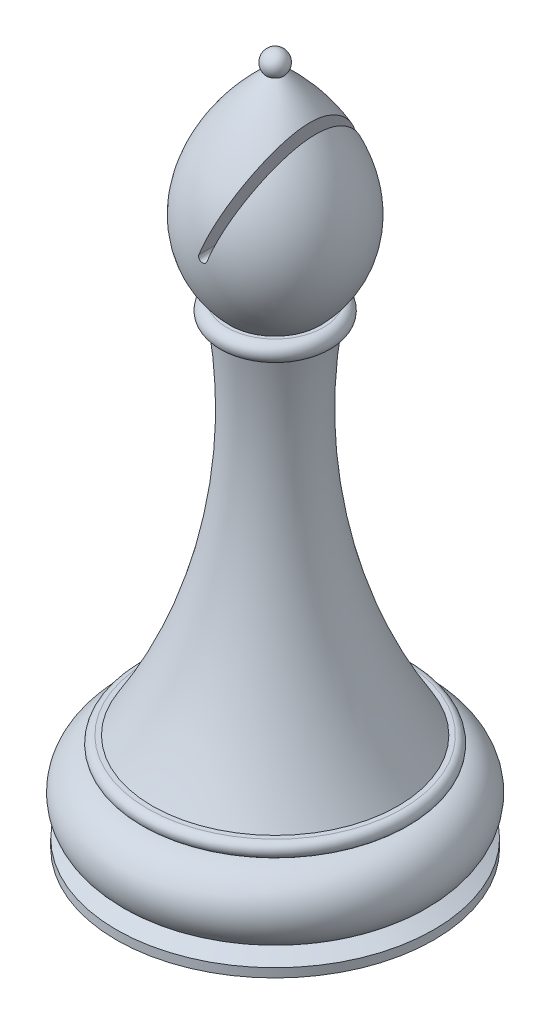
ISO-10303-21;
HEADER;
FILE_DESCRIPTION(('STEP AP214'),'2;1');
FILE_NAME('part.step','',(''),(''),'','','');
FILE_SCHEMA(('AUTOMOTIVE_DESIGN { 1 0 10303 214 1 1 1 1 }'));
ENDSEC;
DATA;
#1=APPLICATION_CONTEXT('core data for automotive mechanical design processes');
#2=APPLICATION_PROTOCOL_DEFINITION('international standard','automotive_design',2000,#1);
#3=PRODUCT_CONTEXT('',#1,'mechanical');
#4=PRODUCT('Part','Part','',(#3));
#5=PRODUCT_RELATED_PRODUCT_CATEGORY('part','',(#4));
#6=PRODUCT_DEFINITION_FORMATION('','',#4);
#7=PRODUCT_DEFINITION_CONTEXT('part definition',#1,'design');
#8=PRODUCT_DEFINITION('design','',#6,#7);
#9=PRODUCT_DEFINITION_SHAPE('','',#8);
#10=(LENGTH_UNIT() NAMED_UNIT(*) SI_UNIT(.MILLI.,.METRE.));
#11=(NAMED_UNIT(*) PLANE_ANGLE_UNIT() SI_UNIT($,.RADIAN.));
#12=(NAMED_UNIT(*) SI_UNIT($,.STERADIAN.) SOLID_ANGLE_UNIT());
#13=UNCERTAINTY_MEASURE_WITH_UNIT(LENGTH_MEASURE(1.E-05),#10,'distance_accuracy_value','');
#14=(GEOMETRIC_REPRESENTATION_CONTEXT(3) GLOBAL_UNCERTAINTY_ASSIGNED_CONTEXT((#13)) GLOBAL_UNIT_ASSIGNED_CONTEXT((#10,
#11,#12)) REPRESENTATION_CONTEXT('',''));
#15=CARTESIAN_POINT('',(0.,0.,0.));
#16=DIRECTION('',(0.,0.,1.));
#17=DIRECTION('',(1.,0.,0.));
#18=AXIS2_PLACEMENT_3D('',#15,#16,#17);
#19=CARTESIAN_POINT('',(0.,36.9784470449583,0.));
#20=DIRECTION('',(0.,1.,0.));
#21=DIRECTION('',(0.,0.,1.));
#22=AXIS2_PLACEMENT_3D('',#19,#20,#21);
#23=PLANE('',#22);
#24=CARTESIAN_POINT('',(0.,36.9784470449583,0.));
#25=DIRECTION('',(0.,1.,0.));
#26=DIRECTION('',(0.,0.,1.));
#27=AXIS2_PLACEMENT_3D('',#24,#25,#26);
#28=CIRCLE('',#27,4.72944569700411);
#29=CARTESIAN_POINT('',(0.,36.9784470449583,4.72944569700411));
#30=VERTEX_POINT('',#29);
#31=EDGE_CURVE('E80',#30,#30,#28,.T.);
#32=ORIENTED_EDGE('',*,*,#31,.T.);
#33=EDGE_LOOP('',(#32));
#34=FACE_BOUND('',#33,.T.);
#35=CARTESIAN_POINT('',(0.,36.9784470449583,0.));
#36=DIRECTION('',(0.,1.,0.));
#37=DIRECTION('',(0.,0.,1.));
#38=AXIS2_PLACEMENT_3D('',#35,#36,#37);
#39=CIRCLE('',#38,4.3896081644279);
#40=CARTESIAN_POINT('',(0.,36.9784470449583,4.3896081644279));
#41=VERTEX_POINT('',#40);
#42=EDGE_CURVE('E72',#41,#41,#39,.T.);
#43=ORIENTED_EDGE('',*,*,#42,.F.);
#44=EDGE_LOOP('',(#43));
#45=FACE_BOUND('',#44,.T.);
#46=ADVANCED_FACE('F37',(#34,#45),#23,.T.);
#47=CARTESIAN_POINT('',(0.,57.1409039617706,0.));
#48=CARTESIAN_POINT('',(8.61172594802059,49.7983263734243,0.));
#49=CARTESIAN_POINT('',(9.38242243643497,41.9727549857802,0.));
#50=CARTESIAN_POINT('',(4.38960816442791,36.9784470449583,0.));
#51=B_SPLINE_CURVE_WITH_KNOTS('',3,(#47,#48,#49,#50),.UNSPECIFIED.,.F.,.F.,(4,4),(0.,
0.785114143224246),.UNSPECIFIED.);
#52=CARTESIAN_POINT('',(0.,0.,0.));
#53=DIRECTION('',(0.,1.,0.));
#54=AXIS1_PLACEMENT('',#52,#53);
#55=SURFACE_OF_REVOLUTION('',#51,#54);
#56=CARTESIAN_POINT('',(0.733907030203132,44.2730125457096,7.4454363789582));
#57=CARTESIAN_POINT('',(0.826755817906949,44.5226929652169,7.43440604822771));
#58=CARTESIAN_POINT('',(0.919424793475852,44.7718898504704,7.41251392828907));
#59=CARTESIAN_POINT('',(1.10382431653597,45.2677600865091,7.34796028636145));
#60=CARTESIAN_POINT('',(1.19555541447912,45.5144349175189,7.30531175716813));
#61=CARTESIAN_POINT('',(1.37738341438092,46.0033900500132,7.20031866418594));
#62=CARTESIAN_POINT('',(1.46748391554859,46.2456800301594,7.13802508999688));
#63=CARTESIAN_POINT('',(1.64587025702048,46.7253801713735,6.99472045713961));
#64=CARTESIAN_POINT('',(1.73415573404838,46.962789355552,6.91370569039474));
#65=CARTESIAN_POINT('',(1.91789320240284,47.4568792549731,6.72428224015033));
#66=CARTESIAN_POINT('',(2.0130936810983,47.7128836255826,6.61386353570363));
#67=CARTESIAN_POINT('',(2.20028829960596,48.2162701752013,6.37253136502893));
#68=CARTESIAN_POINT('',(2.29228212959447,48.463651521061,6.24161592509743));
#69=CARTESIAN_POINT('',(2.47274658625777,48.9489399384993,5.96007648026663));
#70=CARTESIAN_POINT('',(2.56121045031514,49.1868288246691,5.80941681186059));
#71=CARTESIAN_POINT('',(2.73390565729259,49.6512248904807,5.48935162962437));
#72=CARTESIAN_POINT('',(2.81813772435128,49.8777340174094,5.31994933899906));
#73=CARTESIAN_POINT('',(2.9680988748079,50.2809957495415,4.99256679133824));
#74=CARTESIAN_POINT('',(3.0345722265922,50.4597497728304,4.83738745820486));
#75=CARTESIAN_POINT('',(3.16366692713893,50.8068993671956,4.51426597415873));
#76=CARTESIAN_POINT('',(3.22628785852601,50.9752938159044,4.34632244474999));
#77=CARTESIAN_POINT('',(3.34690185993734,51.2996378942234,3.99783446902832));
#78=CARTESIAN_POINT('',(3.40490308052126,51.455609441569,3.8173133184066));
#79=CARTESIAN_POINT('',(3.51548520017759,51.7529767062216,3.44310400010293));
#80=CARTESIAN_POINT('',(3.56806887442076,51.8943798862626,3.24942265904315));
#81=CARTESIAN_POINT('',(3.64817642366819,52.1097977392733,2.92334995869069));
#82=CARTESIAN_POINT('',(3.67773067278747,52.1892723075559,2.79505009894472));
#83=CARTESIAN_POINT('',(3.73381803575491,52.3400972850391,2.53305008886002));
#84=CARTESIAN_POINT('',(3.7603505186107,52.411445997433,2.39934881848917));
#85=CARTESIAN_POINT('',(3.80987385571422,52.5446196003329,2.1268469697959));
#86=CARTESIAN_POINT('',(3.83286930072745,52.6064568359032,1.98805329593343));
#87=CARTESIAN_POINT('',(3.87480370716973,52.7192229845114,1.70556475218944));
#88=CARTESIAN_POINT('',(3.89374524781664,52.7701588333447,1.56187306644892));
#89=CARTESIAN_POINT('',(3.92410758378489,52.8518064344524,1.29561888537211));
#90=CARTESIAN_POINT('',(3.93626405093708,52.884496487746,1.17374723592141));
#91=CARTESIAN_POINT('',(3.95712670189097,52.9405984097099,0.927589525064135));
#92=CARTESIAN_POINT('',(3.96583328536356,52.9640113531384,0.803303745086953));
#93=CARTESIAN_POINT('',(3.9795370596699,53.000862282507,0.553175225083757));
#94=CARTESIAN_POINT('',(3.98453794790712,53.0143102111645,0.427334164698348));
#95=CARTESIAN_POINT('',(3.99068472844329,53.0308395679913,0.174871827150178));
#96=CARTESIAN_POINT('',(3.99183059827515,53.0339209357442,0.0482505454445859));
#97=CARTESIAN_POINT('',(3.9902279904956,53.0296113503139,-0.20491409534417));
#98=CARTESIAN_POINT('',(3.98747561682377,53.0222099202035,-0.331457249835229));
#99=CARTESIAN_POINT('',(3.97816092925459,52.9971617191729,-0.583373327331995));
#100=CARTESIAN_POINT('',(3.97159862537914,52.9795149752027,-0.708746253415069));
#101=CARTESIAN_POINT('',(3.95485978142686,52.9345024157129,-0.957590723745254));
#102=CARTESIAN_POINT('',(3.94468006749866,52.9071280653642,-1.0810604986268));
#103=CARTESIAN_POINT('',(3.92098304565253,52.8434042139071,-1.32538612420962));
#104=CARTESIAN_POINT('',(3.9074637918935,52.8070494802217,-1.44624040613798));
#105=CARTESIAN_POINT('',(3.87177393041136,52.7110755875367,-1.72951493355215));
#106=CARTESIAN_POINT('',(3.84825964742706,52.6478431406182,-1.89054588190079));
#107=CARTESIAN_POINT('',(3.79635230237821,52.5082586828367,-2.2060172063677));
#108=CARTESIAN_POINT('',(3.76795662108209,52.4318996285771,-2.36045398840037));
#109=CARTESIAN_POINT('',(3.70697332014779,52.26790894505,-2.66277521577281));
#110=CARTESIAN_POINT('',(3.67437652660897,52.1802526461726,-2.81064434001443));
#111=CARTESIAN_POINT('',(3.60567037821029,51.9954943916046,-3.09945249720473));
#112=CARTESIAN_POINT('',(3.56956099023351,51.898392346859,-3.24039146479666));
#113=CARTESIAN_POINT('',(3.47293563593887,51.6385563318505,-3.59373346246044));
#114=CARTESIAN_POINT('',(3.41021799744106,51.4699018272748,-3.80119640412418));
#115=CARTESIAN_POINT('',(3.27881752920076,51.1165517745165,-4.19997692327133));
#116=CARTESIAN_POINT('',(3.21013140502158,50.9318473672377,-4.39128546763496));
#117=CARTESIAN_POINT('',(3.06771427944934,50.5488723329128,-4.75821643910134));
#118=CARTESIAN_POINT('',(2.99397754080658,50.3505862777824,-4.93382048677649));
#119=CARTESIAN_POINT('',(2.84225643117181,49.9425918253124,-5.26906507967802));
#120=CARTESIAN_POINT('',(2.76427285850365,49.7328855747518,-5.4287086092863));
#121=CARTESIAN_POINT('',(2.60095657292474,49.2937104416764,-5.73864374325561));
#122=CARTESIAN_POINT('',(2.51545101358735,49.0637767564498,-5.88818735980509));
#123=CARTESIAN_POINT('',(2.34087106105433,48.5943124062522,-6.1688999929199));
#124=CARTESIAN_POINT('',(2.25179629623957,48.3547807419572,-6.30006708972936));
#125=CARTESIAN_POINT('',(1.98027133287802,47.6246207858028,-6.66408001344689));
#126=CARTESIAN_POINT('',(1.79300223409964,47.121033950691,-6.8684209991736));
#127=CARTESIAN_POINT('',(1.46047656701746,46.2268365130371,-7.14814353645107));
#128=CARTESIAN_POINT('',(1.31721316005643,45.8415857366438,-7.24334060345302));
#129=CARTESIAN_POINT('',(1.09998006633427,45.2574224824671,-7.34826254458487));
#130=CARTESIAN_POINT('',(1.02709631447801,45.0614302009439,-7.37693507126104));
#131=CARTESIAN_POINT('',(0.880816545323486,44.6680681007899,-7.42115105986908));
#132=CARTESIAN_POINT('',(0.807420323435616,44.4706977319955,-7.43668893555976));
#133=CARTESIAN_POINT('',(0.733907030203128,44.2730125457096,-7.4454363789582));
#134=B_SPLINE_CURVE_WITH_KNOTS('',3,(#56,#57,#58,#59,#60,#61,#62,#63,#64,#65,#66,#67,#68,#69,
#70,#71,#72,#73,#74,#75,#76,#77,#78,#79,#80,#81,#82,#83,#84,#85,#86,#87,#88,#89,#90,#91,#92,#93,
#94,#95,#96,#97,#98,#99,#100,#101,#102,#103,#104,#105,#106,#107,#108,#109,#110,#111,#112,#113,
#114,#115,#116,#117,#118,#119,#120,#121,#122,#123,#124,#125,#126,#127,#128,#129,#130,#131,#132,
#133),.UNSPECIFIED.,.F.,.F.,(4,2,2,2,2,2,2,2,2,2,2,2,2,2,2,2,2,2,2,2,2,2,2,2,2,2,2,2,2,2,2,2,2,
2,2,2,2,2,4),(0.,0.799524790601596,1.59854974873583,2.39551763789129,3.19264351670808,
4.07557256798236,4.95858669198285,5.84321835078512,6.72769811354874,7.46478467147629,
8.20195094602673,8.93778641933541,9.67324306248616,10.1343215988829,10.5954962398884,
11.0560671718701,11.5163441976704,11.8962641680087,12.2761401115358,12.6556365168718,
13.0351351339139,13.4150133048044,13.7948904764422,14.1751017718479,14.5555351287213,
15.0784866707291,15.601719695836,16.1261152946876,16.6505158380475,17.4731386231721,
18.2962183928862,19.1202491643037,19.9441255647818,20.8052107801153,21.6663858842177,
23.3834373991223,24.6462059454122,25.2790112130547,25.9120854811335),.UNSPECIFIED.);
#135=CARTESIAN_POINT('',(0.733907030203132,44.2730125457096,7.4454363789582));
#136=VERTEX_POINT('',#135);
#137=CARTESIAN_POINT('',(0.733907030203132,44.2730125457096,-7.4454363789582));
#138=VERTEX_POINT('',#137);
#139=EDGE_CURVE('E11',#136,#138,#134,.T.);
#140=ORIENTED_EDGE('',*,*,#139,.F.);
#141=CARTESIAN_POINT('',(-1.23056946577105E-13,44.5459309354501,7.47586857043774));
#142=CARTESIAN_POINT('',(-0.00769073735361524,44.5253034543444,7.47656489600925));
#143=CARTESIAN_POINT('',(-0.0136057040780173,44.5040195985836,7.4772109298047));
#144=CARTESIAN_POINT('',(-0.0217932390263076,44.460774154118,7.47838952054637));
#145=CARTESIAN_POINT('',(-0.0240683642479139,44.4388130522448,7.47892215692632));
#146=CARTESIAN_POINT('',(-0.0248966142190294,44.3948067909726,7.47986229987358));
#147=CARTESIAN_POINT('',(-0.0234479441545796,44.3727615961552,7.48026974599509));
#148=CARTESIAN_POINT('',(-0.0168712129510625,44.3292298116641,7.48094512950491));
#149=CARTESIAN_POINT('',(-0.0117439114617629,44.3077431076092,7.48121309567659));
#150=CARTESIAN_POINT('',(0.00203816916475349,44.2659575929116,7.48159516646869));
#151=CARTESIAN_POINT('',(0.0106889990606607,44.2456574813465,7.48170944273294));
#152=CARTESIAN_POINT('',(0.0312870336152681,44.2067679621114,7.48177128694784));
#153=CARTESIAN_POINT('',(0.0432388259954951,44.1881809836798,7.48171862180594));
#154=CARTESIAN_POINT('',(0.07006704240656,44.1533128392362,7.48143522109956));
#155=CARTESIAN_POINT('',(0.0849377585110917,44.137027278053,7.48120483053939));
#156=CARTESIAN_POINT('',(0.117218811580259,44.1071593627676,7.48055893790509));
#157=CARTESIAN_POINT('',(0.134632676942235,44.0935808273582,7.48014317697319));
#158=CARTESIAN_POINT('',(0.17145912157518,44.0695592494855,7.47912602362401));
#159=CARTESIAN_POINT('',(0.19086853668818,44.0591113429943,7.47852492214834));
#160=CARTESIAN_POINT('',(0.231191481781675,44.0416013820417,7.47714162851064));
#161=CARTESIAN_POINT('',(0.252107468753663,44.0345450093101,7.47635913569682));
#162=CARTESIAN_POINT('',(0.294837140027839,44.0240373538785,7.47462706269031));
#163=CARTESIAN_POINT('',(0.316651524957899,44.0205889424292,7.47367735012358));
#164=CARTESIAN_POINT('',(0.36050633521873,44.0174041501665,7.47163578876218));
#165=CARTESIAN_POINT('',(0.382546328123475,44.0176616530254,7.47054417711185));
#166=CARTESIAN_POINT('',(0.426333638424837,44.0218698448115,7.46824509850904));
#167=CARTESIAN_POINT('',(0.448079845115479,44.0258319079049,7.46703728503052));
#168=CARTESIAN_POINT('',(0.490564075387551,44.0373425721168,7.46454926138331));
#169=CARTESIAN_POINT('',(0.511303456927992,44.0448861856054,7.46326915406777));
#170=CARTESIAN_POINT('',(0.551281589391728,44.0633711886886,7.46067574469811));
#171=CARTESIAN_POINT('',(0.570515694187021,44.0743226161758,7.45936235524781));
#172=CARTESIAN_POINT('',(0.606843135785194,44.0992880214779,7.45675677615789));
#173=CARTESIAN_POINT('',(0.623939438441421,44.1132976806569,7.45546455935841));
#174=CARTESIAN_POINT('',(0.655570345890263,44.1440217142273,7.45294688359369));
#175=CARTESIAN_POINT('',(0.670099771104132,44.1607414297214,7.45172156297931));
#176=CARTESIAN_POINT('',(0.696118949630374,44.1963731797001,7.44939097013848));
#177=CARTESIAN_POINT('',(0.707613369248528,44.2152817836236,7.44828551517988));
#178=CARTESIAN_POINT('',(0.723597365494547,44.2473795321468,7.44661923481531));
#179=CARTESIAN_POINT('',(0.729100219100249,44.2600695798212,7.44600912088709));
#180=CARTESIAN_POINT('',(0.733907030203133,44.2730125457096,7.4454363789582));
#181=B_SPLINE_CURVE_WITH_KNOTS('',3,(#141,#142,#143,#144,#145,#146,#147,#148,#149,#150,#151,
#152,#153,#154,#155,#156,#157,#158,#159,#160,#161,#162,#163,#164,#165,#166,#167,#168,#169,#170,
#171,#172,#173,#174,#175,#176,#177,#178,#179,#180),.UNSPECIFIED.,.F.,.F.,(4,2,2,2,2,2,2,2,2,2,2,
2,2,2,2,2,2,2,2,4),(0.,0.065989369584702,0.131932361084728,0.197907142085152,0.263868302991194,
0.329755735860008,0.395735204794564,0.461586914314584,0.527530870922397,0.593371833356816,
0.65932271591624,0.725326043001559,0.791220449161169,0.85731783857796,0.923323450236976,
0.98952535524623,1.05563437211642,1.12187530030031,1.18801378240604,1.22946905151401),.UNSPECIFIED.);
#182=CARTESIAN_POINT('',(0.,44.5459309354501,7.47586857043774));
#183=VERTEX_POINT('',#182);
#184=EDGE_CURVE('E68',#183,#136,#181,.T.);
#185=ORIENTED_EDGE('',*,*,#184,.F.);
#186=CARTESIAN_POINT('',(-1.87783816274489E-13,44.5459309354501,-7.47586857043775));
#187=CARTESIAN_POINT('',(0.0916861901524089,44.7924850045607,-7.46756901687327));
#188=CARTESIAN_POINT('',(0.18323383510521,45.0386665106639,-7.44886101409855));
#189=CARTESIAN_POINT('',(0.365513307287141,45.5288357008882,-7.39161022075856));
#190=CARTESIAN_POINT('',(0.456245645443252,45.7728247589471,-7.35308088349314));
#191=CARTESIAN_POINT('',(0.636140914543246,46.2565825695465,-7.25733685718182));
#192=CARTESIAN_POINT('',(0.725308479513355,46.496363783484,-7.20019330820493));
#193=CARTESIAN_POINT('',(0.902051439505605,46.9716446943853,-7.06820789739719));
#194=CARTESIAN_POINT('',(0.989626473365378,47.2071434201446,-6.99336207355425));
#195=CARTESIAN_POINT('',(1.17603901970641,47.7084268932306,-6.8143012143855));
#196=CARTESIAN_POINT('',(1.27455751248455,47.9733537621157,-6.70734805797486));
#197=CARTESIAN_POINT('',(1.46855266271462,48.4950276761196,-6.47272933132334));
#198=CARTESIAN_POINT('',(1.56402899646318,48.7517738507652,-6.34506156567491));
#199=CARTESIAN_POINT('',(1.75175353020654,49.2565853996947,-6.06989178118696));
#200=CARTESIAN_POINT('',(1.84399268496605,49.504626450364,-5.92233902200789));
#201=CARTESIAN_POINT('',(2.02452591450631,49.9900998054987,-5.60861152516583));
#202=CARTESIAN_POINT('',(2.11282054208663,50.2275335965018,-5.44243940840673));
#203=CARTESIAN_POINT('',(2.27470360126586,50.6628546289751,-5.11285139708365));
#204=CARTESIAN_POINT('',(2.34879249713625,50.8620876729305,-4.95145619550768));
#205=CARTESIAN_POINT('',(2.49303253478313,51.2499647147333,-4.61464835230591));
#206=CARTESIAN_POINT('',(2.56318291172384,51.4386066558546,-4.43923300397441));
#207=CARTESIAN_POINT('',(2.69869011789672,51.8030001705178,-4.07456103519668));
#208=CARTESIAN_POINT('',(2.7640572148899,51.9787793551781,-3.88533591496823));
#209=CARTESIAN_POINT('',(2.88914159202089,52.3151447566909,-3.49213382296411));
#210=CARTESIAN_POINT('',(2.94886257190482,52.4757409225603,-3.28816666805974));
#211=CARTESIAN_POINT('',(3.03583033636045,52.7096066352956,-2.95997752162308));
#212=CARTESIAN_POINT('',(3.0655894104237,52.7896319999776,-2.84121063388183));
#213=CARTESIAN_POINT('',(3.1225738713063,52.9428693706581,-2.59878718669358));
#214=CARTESIAN_POINT('',(3.14979995016546,53.0160832376264,-2.47513197601919));
#215=CARTESIAN_POINT('',(3.2012643701352,53.1544766220266,-2.22292684257835));
#216=CARTESIAN_POINT('',(3.22550533085047,53.2196631838584,-2.09438134288234));
#217=CARTESIAN_POINT('',(3.27049402860075,53.3406426517137,-1.8323340169799));
#218=CARTESIAN_POINT('',(3.29124245117786,53.3964374012338,-1.69883316974081));
#219=CARTESIAN_POINT('',(3.32515114255857,53.4876215351173,-1.45250229687207));
#220=CARTESIAN_POINT('',(3.33900493145027,53.5248758699105,-1.34045941450897));
#221=CARTESIAN_POINT('',(3.36365247151754,53.5911557675378,-1.11364643484223));
#222=CARTESIAN_POINT('',(3.3744470981285,53.6201836845124,-0.998877127965089));
#223=CARTESIAN_POINT('',(3.39264368627502,53.6691162756038,-0.767301750519156));
#224=CARTESIAN_POINT('',(3.40005053363671,53.6890340882348,-0.650498866918007));
#225=CARTESIAN_POINT('',(3.4112375127922,53.7191170835829,-0.415460716442452));
#226=CARTESIAN_POINT('',(3.41501772620943,53.7292824857942,-0.297225481866144));
#227=CARTESIAN_POINT('',(3.41881561713441,53.7394954247334,-0.0597333223388497));
#228=CARTESIAN_POINT('',(3.41881672567826,53.7394984057275,0.0595258092804918));
#229=CARTESIAN_POINT('',(3.41501494274515,53.7292750007581,0.297537517246781));
#230=CARTESIAN_POINT('',(3.41121206933964,53.7190486633906,0.416290095997501));
#231=CARTESIAN_POINT('',(3.39994170259687,53.6887414298129,0.652486775034257));
#232=CARTESIAN_POINT('',(3.39246984243453,53.6686487907384,0.769929145140359));
#233=CARTESIAN_POINT('',(3.37412133015419,53.6193076592406,1.002595881061));
#234=CARTESIAN_POINT('',(3.36324416233132,53.5900577800312,1.11781990811895));
#235=CARTESIAN_POINT('',(3.33469331635187,53.5132814711774,1.37957544305276));
#236=CARTESIAN_POINT('',(3.31595982957579,53.4629051016762,1.52515610126642));
#237=CARTESIAN_POINT('',(3.27404540418513,53.3501926842738,1.81101482278018));
#238=CARTESIAN_POINT('',(3.25086071521932,53.2878465512729,1.95128829436398));
#239=CARTESIAN_POINT('',(3.20070529148869,53.1529731991554,2.22649733296433));
#240=CARTESIAN_POINT('',(3.17372642045385,53.0804241007297,2.36142060821921));
#241=CARTESIAN_POINT('',(3.11662954613459,52.9268844381752,2.62558667071897));
#242=CARTESIAN_POINT('',(3.08651233247096,52.8458959974221,2.75483087526406));
#243=CARTESIAN_POINT('',(3.00183369513966,52.6181859947919,3.09550770941875));
#244=CARTESIAN_POINT('',(2.94478812682139,52.4647842996161,3.30187274630613));
#245=CARTESIAN_POINT('',(2.82477801115876,52.1420641353051,3.69993569879938));
#246=CARTESIAN_POINT('',(2.7618095272615,51.9727350803539,3.89162370389008));
#247=CARTESIAN_POINT('',(2.63093502924619,51.6207994183439,4.26137055084473));
#248=CARTESIAN_POINT('',(2.5630187317149,51.4381651580761,4.4393993315154));
#249=CARTESIAN_POINT('',(2.42313884663956,51.0620130375147,4.78169908158659));
#250=CARTESIAN_POINT('',(2.35117585630101,50.8684967831711,4.94597207218779));
#251=CARTESIAN_POINT('',(2.17972102702735,50.4074362269871,5.31207648617393));
#252=CARTESIAN_POINT('',(2.07888377377989,50.1362739607314,5.50876173271726));
#253=CARTESIAN_POINT('',(1.87190226015111,49.5796783127828,5.87744618595681));
#254=CARTESIAN_POINT('',(1.76575617891484,49.2942400346143,6.04943684336615));
#255=CARTESIAN_POINT('',(1.4408717080529,48.4205905989833,6.52544690887147));
#256=CARTESIAN_POINT('',(1.21492291848265,47.8129898972143,6.79113217542682));
#257=CARTESIAN_POINT('',(0.903301229990784,46.9750055160003,7.06661184950237));
#258=CARTESIAN_POINT('',(0.823003684135576,46.7590767415875,7.12984017415348));
#259=CARTESIAN_POINT('',(0.661153607404032,46.3238444024788,7.24137176319738));
#260=CARTESIAN_POINT('',(0.579601445907534,46.1045418310851,7.28967933545301));
#261=CARTESIAN_POINT('',(0.415381531357512,45.6629367420965,7.37066897499027));
#262=CARTESIAN_POINT('',(0.332711777350886,45.4406288437226,7.40331764916124));
#263=CARTESIAN_POINT('',(0.166732963191005,44.9942938836897,7.45214364122228));
#264=CARTESIAN_POINT('',(0.0834235314924852,44.7702658229053,7.46831051999129));
#265=CARTESIAN_POINT('',(0.,44.54593093545,7.47586857043773));
#266=B_SPLINE_CURVE_WITH_KNOTS('',3,(#186,#187,#188,#189,#190,#191,#192,#193,#194,#195,#196,
#197,#198,#199,#200,#201,#202,#203,#204,#205,#206,#207,#208,#209,#210,#211,#212,#213,#214,#215,
#216,#217,#218,#219,#220,#221,#222,#223,#224,#225,#226,#227,#228,#229,#230,#231,#232,#233,#234,
#235,#236,#237,#238,#239,#240,#241,#242,#243,#244,#245,#246,#247,#248,#249,#250,#251,#252,#253,
#254,#255,#256,#257,#258,#259,#260,#261,#262,#263,#264,#265),.UNSPECIFIED.,.F.,.F.,(4,2,2,2,2,2,
2,2,2,2,2,2,2,2,2,2,2,2,2,2,2,2,2,2,2,2,2,2,2,2,2,2,2,2,2,2,2,2,2,4),(0.,0.78923706370086,
1.57793915525913,2.36366166041368,3.1495601877388,4.05530217661618,4.9611402220111,
5.86933506781099,6.77740223422141,7.57752003574699,8.37779268151401,9.17629375406496,
9.97426791050343,10.4128689209163,10.8513497470377,11.2894429977985,11.7274501557337,
12.0837871543535,12.4400220773979,12.7957416088762,13.1514531341055,13.5087242254405,
13.865993619508,14.2236892697716,14.5814391162228,15.0462573543967,15.5114689566778,
15.9776938205219,16.4438016620892,17.2327046424498,18.0221357077491,18.813257080437,
19.6042620053494,20.6523587615567,21.7008174993033,23.7896321480826,24.506014967664,
25.2221907621698,25.939887108053,26.6580377414056),.UNSPECIFIED.);
#267=CARTESIAN_POINT('',(0.,44.5459309354501,-7.47586857043775));
#268=VERTEX_POINT('',#267);
#269=EDGE_CURVE('E64',#268,#183,#266,.T.);
#270=ORIENTED_EDGE('',*,*,#269,.F.);
#271=CARTESIAN_POINT('',(0.733907030203132,44.2730125457096,-7.4454363789582));
#272=CARTESIAN_POINT('',(0.726237744188731,44.2523357359868,-7.44635060187624));
#273=CARTESIAN_POINT('',(0.716791785210404,44.2323306084104,-7.44735985540194));
#274=CARTESIAN_POINT('',(0.694698034351575,44.1942029511871,-7.4495227486253));
#275=CARTESIAN_POINT('',(0.682052771005736,44.1760789506909,-7.45067627393698));
#276=CARTESIAN_POINT('',(0.653892934103179,44.1422115455465,-7.45308411551272));
#277=CARTESIAN_POINT('',(0.638377175686931,44.1264691288444,-7.45433847327622));
#278=CARTESIAN_POINT('',(0.604928424291505,44.0978172463655,-7.45689765616114));
#279=CARTESIAN_POINT('',(0.58699584515956,44.0849072965602,-7.45820247261498));
#280=CARTESIAN_POINT('',(0.549207050937631,44.0622758010223,-7.46081383135771));
#281=CARTESIAN_POINT('',(0.529349791196551,44.0525559994887,-7.46212037419987));
#282=CARTESIAN_POINT('',(0.488252933483663,44.0365787873874,-7.46468870256815));
#283=CARTESIAN_POINT('',(0.467011435861035,44.0303262518914,-7.46595042275286));
#284=CARTESIAN_POINT('',(0.423802474126914,44.0214899853839,-7.46838252768912));
#285=CARTESIAN_POINT('',(0.401835991263172,44.0189014880446,-7.46955302922399));
#286=CARTESIAN_POINT('',(0.357742986786208,44.017453385722,-7.47176981866329));
#287=CARTESIAN_POINT('',(0.33561628439282,44.018598997932,-7.47281593065867));
#288=CARTESIAN_POINT('',(0.291926861811367,44.0245927804274,-7.4747508751185));
#289=CARTESIAN_POINT('',(0.270362729877039,44.029430523379,-7.47564014185376));
#290=CARTESIAN_POINT('',(0.228312384569747,44.042672999341,-7.47724677925833));
#291=CARTESIAN_POINT('',(0.207828020361986,44.0510836414543,-7.47796386206913));
#292=CARTESIAN_POINT('',(0.168595413427379,44.0712182847594,-7.47921212621701));
#293=CARTESIAN_POINT('',(0.149844323601628,44.0829367193572,-7.47974361654939));
#294=CARTESIAN_POINT('',(0.114604858441396,44.1093383434221,-7.48061859251431));
#295=CARTESIAN_POINT('',(0.0981127479182404,44.124016537119,-7.48096239137312));
#296=CARTESIAN_POINT('',(0.0678177045556355,44.155940317428,-7.48146711882779));
#297=CARTESIAN_POINT('',(0.0540158694073343,44.1731869469762,-7.48162797290707));
#298=CARTESIAN_POINT('',(0.0295202591977875,44.2097270996994,-7.48177527181391));
#299=CARTESIAN_POINT('',(0.0188221543837162,44.2290177196517,-7.48176196081201));
#300=CARTESIAN_POINT('',(0.000800950332346205,44.2691416426665,-7.48157359890314));
#301=CARTESIAN_POINT('',(-0.00651828184721818,44.2899766818077,-7.48139836336131));
#302=CARTESIAN_POINT('',(-0.0175481112476018,44.3325481973956,-7.48090017634127));
#303=CARTESIAN_POINT('',(-0.021263743367023,44.3542833717544,-7.48057743189135));
#304=CARTESIAN_POINT('',(-0.0250052050174822,44.3981062087086,-7.47979779281199));
#305=CARTESIAN_POINT('',(-0.0250241579588494,44.4201944517886,-7.47934064975458));
#306=CARTESIAN_POINT('',(-0.0213524170276196,44.4640290118981,-7.47830653152381));
#307=CARTESIAN_POINT('',(-0.0176674211616322,44.4857758020158,-7.47772974149222));
#308=CARTESIAN_POINT('',(-0.00881004704210485,44.5202164158739,-7.47670910000086));
#309=CARTESIAN_POINT('',(-0.00473949975969323,44.5332022478565,-7.47629834210864));
#310=CARTESIAN_POINT('',(0.,44.54593093545,-7.47586857043774));
#311=B_SPLINE_CURVE_WITH_KNOTS('',3,(#271,#272,#273,#274,#275,#276,#277,#278,#279,#280,#281,
#282,#283,#284,#285,#286,#287,#288,#289,#290,#291,#292,#293,#294,#295,#296,#297,#298,#299,#300,
#301,#302,#303,#304,#305,#306,#307,#308,#309,#310),.UNSPECIFIED.,.F.,.F.,(4,2,2,2,2,2,2,2,2,2,2,
2,2,2,2,2,2,2,2,4),(0.,0.0661274278932727,0.13220275508394,0.198305417408763,0.264396774911547,
0.330524207599454,0.396744383054964,0.46287833723903,0.529104731520583,0.595144777876646,
0.661294473590287,0.727333504752491,0.793261988067064,0.859217315591621,0.925080187036931,
0.991018251586691,1.05686405512109,1.12283234433528,1.18869930565583,1.22946757212788),.UNSPECIFIED.);
#312=EDGE_CURVE('E48',#138,#268,#311,.T.);
#313=ORIENTED_EDGE('',*,*,#312,.F.);
#314=EDGE_LOOP('',(#140,#185,#270,#313));
#315=FACE_BOUND('',#314,.T.);
#316=ORIENTED_EDGE('',*,*,#42,.T.);
#317=EDGE_LOOP('',(#316));
#318=FACE_BOUND('',#317,.T.);
#319=CARTESIAN_POINT('',(0.,56.3915813395235,0.));
#320=DIRECTION('',(0.,1.,0.));
#321=DIRECTION('',(0.,0.,1.));
#322=AXIS2_PLACEMENT_3D('',#319,#320,#321);
#323=CIRCLE('',#322,0.8500077829545);
#324=CARTESIAN_POINT('',(0.,56.3915813395235,0.8500077829545));
#325=VERTEX_POINT('',#324);
#326=EDGE_CURVE('E168',#325,#325,#323,.T.);
#327=ORIENTED_EDGE('',*,*,#326,.F.);
#328=EDGE_LOOP('',(#327));
#329=FACE_BOUND('',#328,.T.);
#330=ADVANCED_FACE('F66',(#315,#318,#329),#55,.F.);
#331=CARTESIAN_POINT('',(0.,57.1409039617706,0.));
#332=DIRECTION('',(0.,1.,0.));
#333=DIRECTION('',(1.,0.,0.));
#334=AXIS2_PLACEMENT_3D('',#331,#332,#333);
#335=SPHERICAL_SURFACE('',#334,1.13313618920873);
#336=ORIENTED_EDGE('',*,*,#326,.T.);
#337=EDGE_LOOP('',(#336));
#338=FACE_BOUND('',#337,.T.);
#339=ADVANCED_FACE('F94',(#338),#335,.T.);
#340=CARTESIAN_POINT('',(0.,-9.62189923178285,0.));
#341=DIRECTION('',(0.,1.,0.));
#342=DIRECTION('',(0.,0.,1.));
#343=AXIS2_PLACEMENT_3D('',#340,#341,#342);
#344=PLANE('',#343);
#345=CARTESIAN_POINT('',(0.,-9.62189923178285,0.));
#346=DIRECTION('',(0.,1.,0.));
#347=DIRECTION('',(0.,0.,1.));
#348=AXIS2_PLACEMENT_3D('',#345,#346,#347);
#349=CIRCLE('',#348,15.5626838299203);
#350=CARTESIAN_POINT('',(0.,-9.62189923178285,15.5626838299203));
#351=VERTEX_POINT('',#350);
#352=EDGE_CURVE('E170',#351,#351,#349,.T.);
#353=ORIENTED_EDGE('',*,*,#352,.F.);
#354=EDGE_LOOP('',(#353));
#355=FACE_BOUND('',#354,.T.);
#356=ADVANCED_FACE('F150',(#355),#344,.F.);
#357=CARTESIAN_POINT('',(0.,0.,0.));
#358=DIRECTION('',(0.,1.,0.));
#359=DIRECTION('',(0.,0.,1.));
#360=AXIS2_PLACEMENT_3D('',#357,#358,#359);
#361=CYLINDRICAL_SURFACE('',#360,15.5626838299203);
#362=CARTESIAN_POINT('',(0.,-8.75150019545093,0.));
#363=DIRECTION('',(0.,1.,0.));
#364=DIRECTION('',(0.,0.,1.));
#365=AXIS2_PLACEMENT_3D('',#362,#363,#364);
#366=CIRCLE('',#365,15.5626838299203);
#367=CARTESIAN_POINT('',(0.,-8.75150019545093,15.5626838299203));
#368=VERTEX_POINT('',#367);
#369=EDGE_CURVE('E175',#368,#368,#366,.T.);
#370=ORIENTED_EDGE('',*,*,#369,.F.);
#371=EDGE_LOOP('',(#370));
#372=FACE_BOUND('',#371,.T.);
#373=ORIENTED_EDGE('',*,*,#352,.T.);
#374=EDGE_LOOP('',(#373));
#375=FACE_BOUND('',#374,.T.);
#376=ADVANCED_FACE('F147',(#372,#375),#361,.T.);
#377=CARTESIAN_POINT('',(0.,-8.75150019545093,0.));
#378=DIRECTION('',(0.,-1.,0.));
#379=DIRECTION('',(0.,0.,-1.));
#380=AXIS2_PLACEMENT_3D('',#377,#378,#379);
#381=CONICAL_SURFACE('',#380,15.5626838299203,1.12819899052598);
#382=CARTESIAN_POINT('',(0.,-7.96056000410056,0.));
#383=DIRECTION('',(0.,1.,0.));
#384=DIRECTION('',(0.,0.,1.));
#385=AXIS2_PLACEMENT_3D('',#382,#383,#384);
#386=CIRCLE('',#385,13.8938837061669);
#387=CARTESIAN_POINT('',(0.,-7.96056000410056,13.8938837061669));
#388=VERTEX_POINT('',#387);
#389=EDGE_CURVE('E178',#388,#388,#386,.T.);
#390=ORIENTED_EDGE('',*,*,#389,.F.);
#391=EDGE_LOOP('',(#390));
#392=FACE_BOUND('',#391,.T.);
#393=ORIENTED_EDGE('',*,*,#369,.T.);
#394=EDGE_LOOP('',(#393));
#395=FACE_BOUND('',#394,.T.);
#396=ADVANCED_FACE('F143',(#392,#395),#381,.T.);
#397=CARTESIAN_POINT('',(0.,-4.86326513623308,0.));
#398=DIRECTION('',(0.,1.,0.));
#399=DIRECTION('',(0.,0.,1.));
#400=AXIS2_PLACEMENT_3D('',#397,#398,#399);
#401=TOROIDAL_SURFACE('',#400,12.4225559039821,3.429);
#402=CARTESIAN_POINT('',(0.,-1.43471544038389,0.));
#403=DIRECTION('',(0.,1.,0.));
#404=DIRECTION('',(0.,0.,1.));
#405=AXIS2_PLACEMENT_3D('',#402,#403,#404);
#406=CIRCLE('',#405,12.4781255278103);
#407=CARTESIAN_POINT('',(0.,-1.43471544038389,12.4781255278103));
#408=VERTEX_POINT('',#407);
#409=EDGE_CURVE('E181',#408,#408,#406,.T.);
#410=ORIENTED_EDGE('',*,*,#409,.F.);
#411=EDGE_LOOP('',(#410));
#412=FACE_BOUND('',#411,.T.);
#413=ORIENTED_EDGE('',*,*,#389,.T.);
#414=EDGE_LOOP('',(#413));
#415=FACE_BOUND('',#414,.T.);
#416=ADVANCED_FACE('F139',(#412,#415),#401,.T.);
#417=CARTESIAN_POINT('',(0.,0.,0.));
#418=DIRECTION('',(0.,1.,0.));
#419=DIRECTION('',(0.,0.,1.));
#420=AXIS2_PLACEMENT_3D('',#417,#418,#419);
#421=CYLINDRICAL_SURFACE('',#420,12.4781255278103);
#422=ORIENTED_EDGE('',*,*,#409,.T.);
#423=EDGE_LOOP('',(#422));
#424=FACE_BOUND('',#423,.T.);
#425=CARTESIAN_POINT('',(0.,-1.42836544038389,0.));
#426=DIRECTION('',(0.,1.,0.));
#427=DIRECTION('',(0.,0.,1.));
#428=AXIS2_PLACEMENT_3D('',#425,#426,#427);
#429=CIRCLE('',#428,12.4781255278103);
#430=CARTESIAN_POINT('',(0.,-1.42836544038389,12.4781255278103));
#431=VERTEX_POINT('',#430);
#432=EDGE_CURVE('E184',#431,#431,#429,.T.);
#433=ORIENTED_EDGE('',*,*,#432,.F.);
#434=EDGE_LOOP('',(#433));
#435=FACE_BOUND('',#434,.T.);
#436=ADVANCED_FACE('F135',(#424,#435),#421,.T.);
#437=CARTESIAN_POINT('',(0.,-0.714375,0.));
#438=DIRECTION('',(0.,1.,0.));
#439=DIRECTION('',(0.,0.,1.));
#440=AXIS2_PLACEMENT_3D('',#437,#438,#439);
#441=TOROIDAL_SURFACE('',#440,12.5015625,0.714375);
#442=ORIENTED_EDGE('',*,*,#432,.T.);
#443=EDGE_LOOP('',(#442));
#444=FACE_BOUND('',#443,.T.);
#445=CARTESIAN_POINT('',(0.,0.,0.));
#446=DIRECTION('',(0.,1.,0.));
#447=DIRECTION('',(0.,0.,1.));
#448=AXIS2_PLACEMENT_3D('',#445,#446,#447);
#449=CIRCLE('',#448,12.5015625);
#450=CARTESIAN_POINT('',(0.,0.,12.5015625));
#451=VERTEX_POINT('',#450);
#452=EDGE_CURVE('E187',#451,#451,#449,.T.);
#453=ORIENTED_EDGE('',*,*,#452,.F.);
#454=EDGE_LOOP('',(#453));
#455=FACE_BOUND('',#454,.T.);
#456=ADVANCED_FACE('F131',(#444,#455),#441,.T.);
#457=CARTESIAN_POINT('',(0.,0.,0.));
#458=DIRECTION('',(0.,1.,0.));
#459=DIRECTION('',(0.,0.,1.));
#460=AXIS2_PLACEMENT_3D('',#457,#458,#459);
#461=PLANE('',#460);
#462=ORIENTED_EDGE('',*,*,#452,.T.);
#463=EDGE_LOOP('',(#462));
#464=FACE_BOUND('',#463,.T.);
#465=CARTESIAN_POINT('',(0.,0.,0.));
#466=DIRECTION('',(0.,1.,0.));
#467=DIRECTION('',(0.,0.,1.));
#468=AXIS2_PLACEMENT_3D('',#465,#466,#467);
#469=CIRCLE('',#468,12.0459229889355);
#470=CARTESIAN_POINT('',(0.,0.,12.0459229889355));
#471=VERTEX_POINT('',#470);
#472=EDGE_CURVE('E190',#471,#471,#469,.T.);
#473=ORIENTED_EDGE('',*,*,#472,.F.);
#474=EDGE_LOOP('',(#473));
#475=FACE_BOUND('',#474,.T.);
#476=ADVANCED_FACE('F127',(#464,#475),#461,.T.);
#477=CARTESIAN_POINT('',(0.,27.7476610979473,0.));
#478=DIRECTION('',(0.,1.,0.));
#479=DIRECTION('',(0.,0.,1.));
#480=AXIS2_PLACEMENT_3D('',#477,#478,#479);
#481=TOROIDAL_SURFACE('',#480,56.712733761224,52.5838062617567);
#482=ORIENTED_EDGE('',*,*,#472,.T.);
#483=EDGE_LOOP('',(#482));
#484=FACE_BOUND('',#483,.T.);
#485=CARTESIAN_POINT('',(0.,35.183948261325,0.));
#486=DIRECTION('',(0.,1.,0.));
#487=DIRECTION('',(0.,0.,1.));
#488=AXIS2_PLACEMENT_3D('',#485,#486,#487);
#489=CIRCLE('',#488,4.65739480163452);
#490=CARTESIAN_POINT('',(0.,35.183948261325,4.65739480163452));
#491=VERTEX_POINT('',#490);
#492=EDGE_CURVE('E192',#491,#491,#489,.T.);
#493=ORIENTED_EDGE('',*,*,#492,.F.);
#494=EDGE_LOOP('',(#493));
#495=FACE_BOUND('',#494,.T.);
#496=ADVANCED_FACE('F123',(#484,#495),#481,.F.);
#497=CARTESIAN_POINT('',(0.,36.0797511958994,0.));
#498=DIRECTION('',(0.,1.,0.));
#499=DIRECTION('',(0.,0.,1.));
#500=AXIS2_PLACEMENT_3D('',#497,#498,#499);
#501=TOROIDAL_SURFACE('',#500,4.72944569700411,0.898695849058893);
#502=ORIENTED_EDGE('',*,*,#492,.T.);
#503=EDGE_LOOP('',(#502));
#504=FACE_BOUND('',#503,.T.);
#505=ORIENTED_EDGE('',*,*,#31,.F.);
#506=EDGE_LOOP('',(#505));
#507=FACE_BOUND('',#506,.T.);
#508=ADVANCED_FACE('F120',(#504,#507),#501,.T.);
#509=CARTESIAN_POINT('',(0.733907030203131,44.2730125457096,-15.8515559039821));
#510=DIRECTION('',(0.93728999551151,-0.34855051902706,0.));
#511=DIRECTION('',(0.34855051902706,0.93728999551151,0.));
#512=AXIS2_PLACEMENT_3D('',#509,#510,#511);
#513=PLANE('',#512);
#514=DIRECTION('',(0.,0.,1.));
#515=VECTOR('',#514,1.);
#516=CARTESIAN_POINT('',(0.733907030203132,44.2730125457096,-15.8515559039821));
#517=LINE('',#516,#515);
#518=EDGE_CURVE('E77',#138,#136,#517,.T.);
#519=ORIENTED_EDGE('',*,*,#518,.T.);
#520=ORIENTED_EDGE('',*,*,#139,.T.);
#521=EDGE_LOOP('',(#519,#520));
#522=FACE_BOUND('',#521,.T.);
#523=ADVANCED_FACE('F114',(#522),#513,.F.);
#524=CARTESIAN_POINT('',(0.366953515101565,44.4094717405799,-15.8515559039821));
#525=DIRECTION('',(0.,0.,1.));
#526=DIRECTION('',(1.,0.,0.));
#527=AXIS2_PLACEMENT_3D('',#524,#525,#526);
#528=CYLINDRICAL_SURFACE('',#527,0.391504781720523);
#529=ORIENTED_EDGE('',*,*,#312,.T.);
#530=DIRECTION('',(0.,0.,1.));
#531=VECTOR('',#530,1.);
#532=CARTESIAN_POINT('',(0.,44.5459309354501,-15.8515559039821));
#533=LINE('',#532,#531);
#534=EDGE_CURVE('E76',#268,#183,#533,.T.);
#535=ORIENTED_EDGE('',*,*,#534,.T.);
#536=ORIENTED_EDGE('',*,*,#184,.T.);
#537=ORIENTED_EDGE('',*,*,#518,.F.);
#538=EDGE_LOOP('',(#529,#535,#536,#537));
#539=FACE_BOUND('',#538,.T.);
#540=ADVANCED_FACE('F75',(#539),#528,.F.);
#541=CARTESIAN_POINT('',(3.41834194285581,53.7382216634327,-15.8515559039821));
#542=DIRECTION('',(-0.93728999551186,0.348550519026121,0.));
#543=DIRECTION('',(-0.348550519026121,-0.93728999551186,0.));
#544=AXIS2_PLACEMENT_3D('',#541,#542,#543);
#545=PLANE('',#544);
#546=ORIENTED_EDGE('',*,*,#534,.F.);
#547=ORIENTED_EDGE('',*,*,#269,.T.);
#548=EDGE_LOOP('',(#546,#547));
#549=FACE_BOUND('',#548,.T.);
#550=ADVANCED_FACE('F78',(#549),#545,.F.);
#551=CLOSED_SHELL('',(#46,#330,#339,#356,#376,#396,#416,#436,#456,#476,#496,#508,#523,#540,#550));
#552=MANIFOLD_SOLID_BREP('B2',#551);
#553=ADVANCED_BREP_SHAPE_REPRESENTATION('',(#18,#552),#14);
#554=SHAPE_DEFINITION_REPRESENTATION(#9,#553);
ENDSEC;
END-ISO-10303-21;
